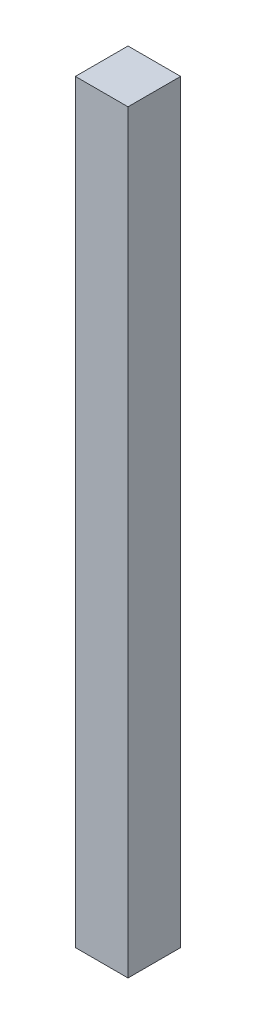
ISO-10303-21;
HEADER;
FILE_DESCRIPTION(('STEP AP214'),'2;1');
FILE_NAME('part.step','',(''),(''),'','','');
FILE_SCHEMA(('AUTOMOTIVE_DESIGN { 1 0 10303 214 1 1 1 1 }'));
ENDSEC;
DATA;
#1=APPLICATION_CONTEXT('core data for automotive mechanical design processes');
#2=APPLICATION_PROTOCOL_DEFINITION('international standard','automotive_design',2000,#1);
#3=PRODUCT_CONTEXT('',#1,'mechanical');
#4=PRODUCT('Part','Part','',(#3));
#5=PRODUCT_RELATED_PRODUCT_CATEGORY('part','',(#4));
#6=PRODUCT_DEFINITION_FORMATION('','',#4);
#7=PRODUCT_DEFINITION_CONTEXT('part definition',#1,'design');
#8=PRODUCT_DEFINITION('design','',#6,#7);
#9=PRODUCT_DEFINITION_SHAPE('','',#8);
#10=(LENGTH_UNIT() NAMED_UNIT(*) SI_UNIT(.MILLI.,.METRE.));
#11=(NAMED_UNIT(*) PLANE_ANGLE_UNIT() SI_UNIT($,.RADIAN.));
#12=(NAMED_UNIT(*) SI_UNIT($,.STERADIAN.) SOLID_ANGLE_UNIT());
#13=UNCERTAINTY_MEASURE_WITH_UNIT(LENGTH_MEASURE(1.E-05),#10,'distance_accuracy_value','');
#14=(GEOMETRIC_REPRESENTATION_CONTEXT(3) GLOBAL_UNCERTAINTY_ASSIGNED_CONTEXT((#13)) GLOBAL_UNIT_ASSIGNED_CONTEXT((#10,
#11,#12)) REPRESENTATION_CONTEXT('',''));
#15=CARTESIAN_POINT('',(0.,0.,0.));
#16=DIRECTION('',(0.,0.,1.));
#17=DIRECTION('',(1.,0.,0.));
#18=AXIS2_PLACEMENT_3D('',#15,#16,#17);
#19=CARTESIAN_POINT('',(0.,86.,0.));
#20=DIRECTION('',(1.,0.,0.));
#21=DIRECTION('',(0.,0.,-1.));
#22=AXIS2_PLACEMENT_3D('',#19,#20,#21);
#23=PLANE('',#22);
#24=DIRECTION('',(0.,0.,1.));
#25=VECTOR('',#24,1.);
#26=CARTESIAN_POINT('',(0.,0.,0.));
#27=LINE('',#26,#25);
#28=CARTESIAN_POINT('',(0.,0.,0.));
#29=VERTEX_POINT('',#28);
#30=CARTESIAN_POINT('',(0.,0.,6.));
#31=VERTEX_POINT('',#30);
#32=EDGE_CURVE('E96',#29,#31,#27,.T.);
#33=ORIENTED_EDGE('',*,*,#32,.T.);
#34=DIRECTION('',(0.,-1.,0.));
#35=VECTOR('',#34,1.);
#36=CARTESIAN_POINT('',(0.,86.,6.));
#37=LINE('',#36,#35);
#38=CARTESIAN_POINT('',(0.,86.,6.));
#39=VERTEX_POINT('',#38);
#40=EDGE_CURVE('E11',#39,#31,#37,.T.);
#41=ORIENTED_EDGE('',*,*,#40,.F.);
#42=DIRECTION('',(0.,0.,1.));
#43=VECTOR('',#42,1.);
#44=CARTESIAN_POINT('',(0.,86.,0.));
#45=LINE('',#44,#43);
#46=CARTESIAN_POINT('',(0.,86.,0.));
#47=VERTEX_POINT('',#46);
#48=EDGE_CURVE('E84',#47,#39,#45,.T.);
#49=ORIENTED_EDGE('',*,*,#48,.F.);
#50=DIRECTION('',(0.,-1.,0.));
#51=VECTOR('',#50,1.);
#52=CARTESIAN_POINT('',(0.,86.,0.));
#53=LINE('',#52,#51);
#54=EDGE_CURVE('E92',#47,#29,#53,.T.);
#55=ORIENTED_EDGE('',*,*,#54,.T.);
#56=EDGE_LOOP('',(#33,#41,#49,#55));
#57=FACE_BOUND('',#56,.T.);
#58=ADVANCED_FACE('F33',(#57),#23,.F.);
#59=CARTESIAN_POINT('',(0.,86.,6.));
#60=DIRECTION('',(0.,0.,-1.));
#61=DIRECTION('',(-1.,0.,0.));
#62=AXIS2_PLACEMENT_3D('',#59,#60,#61);
#63=PLANE('',#62);
#64=DIRECTION('',(1.,0.,0.));
#65=VECTOR('',#64,1.);
#66=CARTESIAN_POINT('',(0.,0.,6.));
#67=LINE('',#66,#65);
#68=CARTESIAN_POINT('',(6.,0.,6.));
#69=VERTEX_POINT('',#68);
#70=EDGE_CURVE('E88',#31,#69,#67,.T.);
#71=ORIENTED_EDGE('',*,*,#70,.T.);
#72=DIRECTION('',(0.,-1.,0.));
#73=VECTOR('',#72,1.);
#74=CARTESIAN_POINT('',(6.,86.,6.));
#75=LINE('',#74,#73);
#76=CARTESIAN_POINT('',(6.,86.,6.));
#77=VERTEX_POINT('',#76);
#78=EDGE_CURVE('E41',#77,#69,#75,.T.);
#79=ORIENTED_EDGE('',*,*,#78,.F.);
#80=DIRECTION('',(1.,0.,0.));
#81=VECTOR('',#80,1.);
#82=CARTESIAN_POINT('',(0.,86.,6.));
#83=LINE('',#82,#81);
#84=EDGE_CURVE('E79',#39,#77,#83,.T.);
#85=ORIENTED_EDGE('',*,*,#84,.F.);
#86=ORIENTED_EDGE('',*,*,#40,.T.);
#87=EDGE_LOOP('',(#71,#79,#85,#86));
#88=FACE_BOUND('',#87,.T.);
#89=ADVANCED_FACE('F87',(#88),#63,.F.);
#90=CARTESIAN_POINT('',(6.,86.,0.));
#91=DIRECTION('',(-1.,0.,0.));
#92=DIRECTION('',(0.,0.,1.));
#93=AXIS2_PLACEMENT_3D('',#90,#91,#92);
#94=PLANE('',#93);
#95=DIRECTION('',(0.,0.,-1.));
#96=VECTOR('',#95,1.);
#97=CARTESIAN_POINT('',(6.,0.,0.));
#98=LINE('',#97,#96);
#99=CARTESIAN_POINT('',(6.,0.,0.));
#100=VERTEX_POINT('',#99);
#101=EDGE_CURVE('E66',#69,#100,#98,.T.);
#102=ORIENTED_EDGE('',*,*,#101,.T.);
#103=DIRECTION('',(0.,-1.,0.));
#104=VECTOR('',#103,1.);
#105=CARTESIAN_POINT('',(6.,86.,0.));
#106=LINE('',#105,#104);
#107=CARTESIAN_POINT('',(6.,86.,0.));
#108=VERTEX_POINT('',#107);
#109=EDGE_CURVE('E89',#108,#100,#106,.T.);
#110=ORIENTED_EDGE('',*,*,#109,.F.);
#111=DIRECTION('',(0.,0.,-1.));
#112=VECTOR('',#111,1.);
#113=CARTESIAN_POINT('',(6.,86.,0.));
#114=LINE('',#113,#112);
#115=EDGE_CURVE('E82',#77,#108,#114,.T.);
#116=ORIENTED_EDGE('',*,*,#115,.F.);
#117=ORIENTED_EDGE('',*,*,#78,.T.);
#118=EDGE_LOOP('',(#102,#110,#116,#117));
#119=FACE_BOUND('',#118,.T.);
#120=ADVANCED_FACE('F90',(#119),#94,.F.);
#121=CARTESIAN_POINT('',(0.,86.,0.));
#122=DIRECTION('',(0.,0.,1.));
#123=DIRECTION('',(1.,0.,0.));
#124=AXIS2_PLACEMENT_3D('',#121,#122,#123);
#125=PLANE('',#124);
#126=DIRECTION('',(-1.,0.,0.));
#127=VECTOR('',#126,1.);
#128=CARTESIAN_POINT('',(0.,0.,0.));
#129=LINE('',#128,#127);
#130=EDGE_CURVE('E72',#100,#29,#129,.T.);
#131=ORIENTED_EDGE('',*,*,#130,.T.);
#132=ORIENTED_EDGE('',*,*,#54,.F.);
#133=DIRECTION('',(-1.,0.,0.));
#134=VECTOR('',#133,1.);
#135=CARTESIAN_POINT('',(0.,86.,0.));
#136=LINE('',#135,#134);
#137=EDGE_CURVE('E49',#108,#47,#136,.T.);
#138=ORIENTED_EDGE('',*,*,#137,.F.);
#139=ORIENTED_EDGE('',*,*,#109,.T.);
#140=EDGE_LOOP('',(#131,#132,#138,#139));
#141=FACE_BOUND('',#140,.T.);
#142=ADVANCED_FACE('F103',(#141),#125,.F.);
#143=CARTESIAN_POINT('',(0.,86.,0.));
#144=DIRECTION('',(0.,1.,0.));
#145=DIRECTION('',(0.,0.,1.));
#146=AXIS2_PLACEMENT_3D('',#143,#144,#145);
#147=PLANE('',#146);
#148=ORIENTED_EDGE('',*,*,#48,.T.);
#149=ORIENTED_EDGE('',*,*,#84,.T.);
#150=ORIENTED_EDGE('',*,*,#115,.T.);
#151=ORIENTED_EDGE('',*,*,#137,.T.);
#152=EDGE_LOOP('',(#148,#149,#150,#151));
#153=FACE_BOUND('',#152,.T.);
#154=ADVANCED_FACE('F80',(#153),#147,.T.);
#155=CARTESIAN_POINT('',(0.,0.,0.));
#156=DIRECTION('',(0.,1.,0.));
#157=DIRECTION('',(0.,0.,1.));
#158=AXIS2_PLACEMENT_3D('',#155,#156,#157);
#159=PLANE('',#158);
#160=ORIENTED_EDGE('',*,*,#32,.F.);
#161=ORIENTED_EDGE('',*,*,#130,.F.);
#162=ORIENTED_EDGE('',*,*,#101,.F.);
#163=ORIENTED_EDGE('',*,*,#70,.F.);
#164=EDGE_LOOP('',(#160,#161,#162,#163));
#165=FACE_BOUND('',#164,.T.);
#166=ADVANCED_FACE('F106',(#165),#159,.F.);
#167=CLOSED_SHELL('',(#58,#89,#120,#142,#154,#166));
#168=MANIFOLD_SOLID_BREP('B2',#167);
#169=ADVANCED_BREP_SHAPE_REPRESENTATION('',(#18,#168),#14);
#170=SHAPE_DEFINITION_REPRESENTATION(#9,#169);
ENDSEC;
END-ISO-10303-21;
